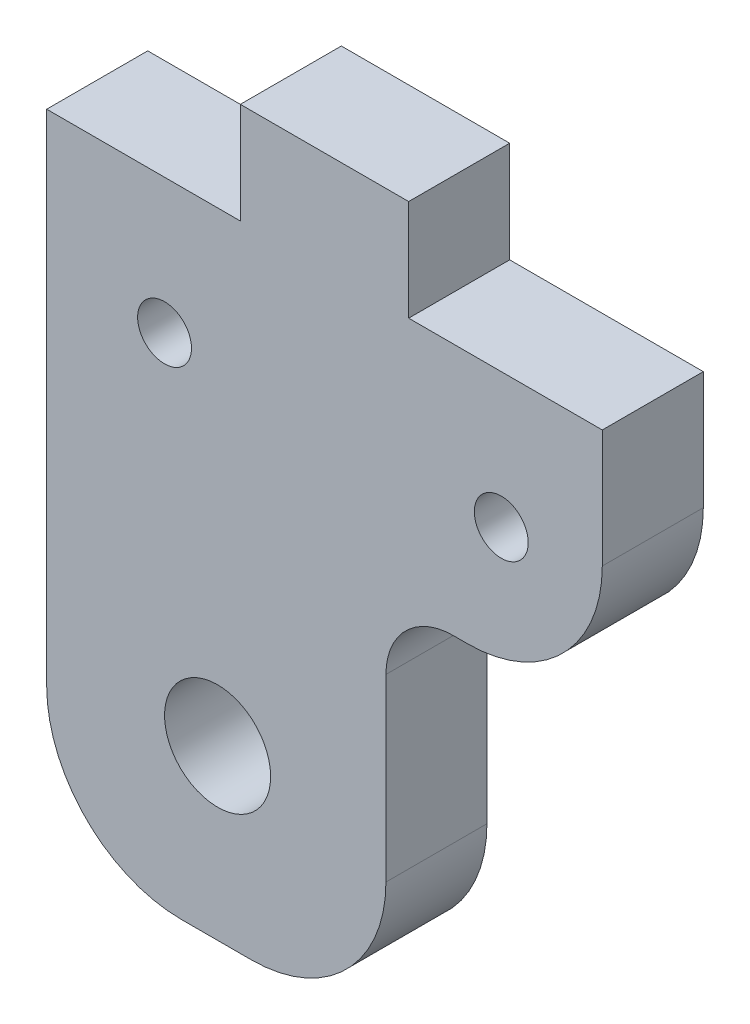
ISO-10303-21;
HEADER;
FILE_DESCRIPTION(('STEP AP214'),'2;1');
FILE_NAME('part.step','',(''),(''),'','','');
FILE_SCHEMA(('AUTOMOTIVE_DESIGN { 1 0 10303 214 1 1 1 1 }'));
ENDSEC;
DATA;
#1=APPLICATION_CONTEXT('core data for automotive mechanical design processes');
#2=APPLICATION_PROTOCOL_DEFINITION('international standard','automotive_design',2000,#1);
#3=PRODUCT_CONTEXT('',#1,'mechanical');
#4=PRODUCT('Part','Part','',(#3));
#5=PRODUCT_RELATED_PRODUCT_CATEGORY('part','',(#4));
#6=PRODUCT_DEFINITION_FORMATION('','',#4);
#7=PRODUCT_DEFINITION_CONTEXT('part definition',#1,'design');
#8=PRODUCT_DEFINITION('design','',#6,#7);
#9=PRODUCT_DEFINITION_SHAPE('','',#8);
#10=(LENGTH_UNIT() NAMED_UNIT(*) SI_UNIT(.MILLI.,.METRE.));
#11=(NAMED_UNIT(*) PLANE_ANGLE_UNIT() SI_UNIT($,.RADIAN.));
#12=(NAMED_UNIT(*) SI_UNIT($,.STERADIAN.) SOLID_ANGLE_UNIT());
#13=UNCERTAINTY_MEASURE_WITH_UNIT(LENGTH_MEASURE(1.E-05),#10,'distance_accuracy_value','');
#14=(GEOMETRIC_REPRESENTATION_CONTEXT(3) GLOBAL_UNCERTAINTY_ASSIGNED_CONTEXT((#13)) GLOBAL_UNIT_ASSIGNED_CONTEXT((#10,
#11,#12)) REPRESENTATION_CONTEXT('',''));
#15=CARTESIAN_POINT('',(0.,0.,0.));
#16=DIRECTION('',(0.,0.,1.));
#17=DIRECTION('',(1.,0.,0.));
#18=AXIS2_PLACEMENT_3D('',#15,#16,#17);
#19=CARTESIAN_POINT('',(29.15,0.,6.));
#20=DIRECTION('',(-1.,0.,0.));
#21=DIRECTION('',(0.,0.,1.));
#22=AXIS2_PLACEMENT_3D('',#19,#20,#21);
#23=PLANE('',#22);
#24=DIRECTION('',(0.,1.,0.));
#25=VECTOR('',#24,1.);
#26=CARTESIAN_POINT('',(29.15,0.,6.));
#27=LINE('',#26,#25);
#28=CARTESIAN_POINT('',(29.15,-29.6808495852448,6.));
#29=VERTEX_POINT('',#28);
#30=CARTESIAN_POINT('',(29.15,-19.,6.));
#31=VERTEX_POINT('',#30);
#32=EDGE_CURVE('E278',#29,#31,#27,.T.);
#33=ORIENTED_EDGE('',*,*,#32,.F.);
#34=DIRECTION('',(0.,0.,1.));
#35=VECTOR('',#34,1.);
#36=CARTESIAN_POINT('',(29.15,-29.6808495852448,0.));
#37=LINE('',#36,#35);
#38=CARTESIAN_POINT('',(29.15,-29.6808495852448,0.));
#39=VERTEX_POINT('',#38);
#40=EDGE_CURVE('E239',#29,#39,#37,.F.);
#41=ORIENTED_EDGE('',*,*,#40,.T.);
#42=DIRECTION('',(0.,1.,0.));
#43=VECTOR('',#42,1.);
#44=CARTESIAN_POINT('',(29.15,0.,0.));
#45=LINE('',#44,#43);
#46=CARTESIAN_POINT('',(29.15,-19.,0.));
#47=VERTEX_POINT('',#46);
#48=EDGE_CURVE('E192',#39,#47,#45,.T.);
#49=ORIENTED_EDGE('',*,*,#48,.T.);
#50=DIRECTION('',(0.,0.,-1.));
#51=VECTOR('',#50,1.);
#52=CARTESIAN_POINT('',(29.15,-19.,6.));
#53=LINE('',#52,#51);
#54=EDGE_CURVE('E218',#47,#31,#53,.F.);
#55=ORIENTED_EDGE('',*,*,#54,.T.);
#56=EDGE_LOOP('',(#33,#41,#49,#55));
#57=FACE_BOUND('',#56,.T.);
#58=ADVANCED_FACE('F35',(#57),#23,.F.);
#59=CARTESIAN_POINT('',(0.,0.,6.));
#60=DIRECTION('',(0.,0.,1.));
#61=DIRECTION('',(1.,0.,0.));
#62=AXIS2_PLACEMENT_3D('',#59,#60,#61);
#63=PLANE('',#62);
#64=CARTESIAN_POINT('',(16.,-8.,6.));
#65=DIRECTION('',(0.,0.,1.));
#66=DIRECTION('',(1.,0.,0.));
#67=AXIS2_PLACEMENT_3D('',#64,#65,#66);
#68=CIRCLE('',#67,1.6);
#69=CARTESIAN_POINT('',(17.6,-8.,6.));
#70=VERTEX_POINT('',#69);
#71=EDGE_CURVE('E263',#70,#70,#68,.T.);
#72=ORIENTED_EDGE('',*,*,#71,.F.);
#73=EDGE_LOOP('',(#72));
#74=FACE_BOUND('',#73,.T.);
#75=CARTESIAN_POINT('',(36.,-8.,6.));
#76=DIRECTION('',(0.,0.,1.));
#77=DIRECTION('',(1.,0.,0.));
#78=AXIS2_PLACEMENT_3D('',#75,#76,#77);
#79=CIRCLE('',#78,1.5999999999999);
#80=CARTESIAN_POINT('',(37.5999999999999,-8.,6.));
#81=VERTEX_POINT('',#80);
#82=EDGE_CURVE('E265',#81,#81,#79,.T.);
#83=ORIENTED_EDGE('',*,*,#82,.F.);
#84=EDGE_LOOP('',(#83));
#85=FACE_BOUND('',#84,.T.);
#86=CARTESIAN_POINT('',(19.15,-27.6808495852448,6.));
#87=DIRECTION('',(0.,0.,1.));
#88=DIRECTION('',(1.,0.,0.));
#89=AXIS2_PLACEMENT_3D('',#86,#87,#88);
#90=CIRCLE('',#89,3.14999999999995);
#91=CARTESIAN_POINT('',(22.3,-27.6808495852448,6.));
#92=VERTEX_POINT('',#91);
#93=EDGE_CURVE('E270',#92,#92,#90,.T.);
#94=ORIENTED_EDGE('',*,*,#93,.F.);
#95=EDGE_LOOP('',(#94));
#96=FACE_BOUND('',#95,.T.);
#97=DIRECTION('',(1.,0.,0.));
#98=VECTOR('',#97,1.);
#99=CARTESIAN_POINT('',(0.,-37.6808495852448,6.));
#100=LINE('',#99,#98);
#101=CARTESIAN_POINT('',(17.,-37.6808495852448,6.));
#102=VERTEX_POINT('',#101);
#103=CARTESIAN_POINT('',(21.15,-37.6808495852448,6.));
#104=VERTEX_POINT('',#103);
#105=EDGE_CURVE('E184',#102,#104,#100,.T.);
#106=ORIENTED_EDGE('',*,*,#105,.T.);
#107=CARTESIAN_POINT('',(21.15,-29.6808495852448,6.));
#108=DIRECTION('',(0.,0.,1.));
#109=DIRECTION('',(1.,0.,0.));
#110=AXIS2_PLACEMENT_3D('',#107,#108,#109);
#111=CIRCLE('',#110,8.);
#112=EDGE_CURVE('E237',#104,#29,#111,.T.);
#113=ORIENTED_EDGE('',*,*,#112,.T.);
#114=ORIENTED_EDGE('',*,*,#32,.T.);
#115=CARTESIAN_POINT('',(33.15,-19.,6.));
#116=DIRECTION('',(0.,0.,1.));
#117=DIRECTION('',(1.,0.,0.));
#118=AXIS2_PLACEMENT_3D('',#115,#116,#117);
#119=CIRCLE('',#118,4.);
#120=CARTESIAN_POINT('',(33.15,-15.,6.));
#121=VERTEX_POINT('',#120);
#122=EDGE_CURVE('E224',#31,#121,#119,.F.);
#123=ORIENTED_EDGE('',*,*,#122,.T.);
#124=DIRECTION('',(1.,0.,0.));
#125=VECTOR('',#124,1.);
#126=CARTESIAN_POINT('',(0.,-15.,6.));
#127=LINE('',#126,#125);
#128=CARTESIAN_POINT('',(34.,-15.,6.));
#129=VERTEX_POINT('',#128);
#130=EDGE_CURVE('E158',#121,#129,#127,.T.);
#131=ORIENTED_EDGE('',*,*,#130,.T.);
#132=CARTESIAN_POINT('',(34.,-7.,6.));
#133=DIRECTION('',(0.,0.,1.));
#134=DIRECTION('',(1.,0.,0.));
#135=AXIS2_PLACEMENT_3D('',#132,#133,#134);
#136=CIRCLE('',#135,8.);
#137=CARTESIAN_POINT('',(42.,-7.,6.));
#138=VERTEX_POINT('',#137);
#139=EDGE_CURVE('E157',#129,#138,#136,.T.);
#140=ORIENTED_EDGE('',*,*,#139,.T.);
#141=DIRECTION('',(0.,-1.,0.));
#142=VECTOR('',#141,1.);
#143=CARTESIAN_POINT('',(42.,0.,6.));
#144=LINE('',#143,#142);
#145=CARTESIAN_POINT('',(42.,0.,6.));
#146=VERTEX_POINT('',#145);
#147=EDGE_CURVE('E139',#146,#138,#144,.T.);
#148=ORIENTED_EDGE('',*,*,#147,.F.);
#149=DIRECTION('',(1.,0.,0.));
#150=VECTOR('',#149,1.);
#151=CARTESIAN_POINT('',(0.,0.,6.));
#152=LINE('',#151,#150);
#153=CARTESIAN_POINT('',(30.5,0.,6.));
#154=VERTEX_POINT('',#153);
#155=EDGE_CURVE('E153',#154,#146,#152,.T.);
#156=ORIENTED_EDGE('',*,*,#155,.F.);
#157=DIRECTION('',(0.,-1.,0.));
#158=VECTOR('',#157,1.);
#159=CARTESIAN_POINT('',(30.5,0.,6.));
#160=LINE('',#159,#158);
#161=CARTESIAN_POINT('',(30.5,6.,6.));
#162=VERTEX_POINT('',#161);
#163=EDGE_CURVE('E161',#162,#154,#160,.T.);
#164=ORIENTED_EDGE('',*,*,#163,.F.);
#165=DIRECTION('',(-1.,0.,0.));
#166=VECTOR('',#165,1.);
#167=CARTESIAN_POINT('',(0.,6.,6.));
#168=LINE('',#167,#166);
#169=CARTESIAN_POINT('',(20.5,6.,6.));
#170=VERTEX_POINT('',#169);
#171=EDGE_CURVE('E164',#162,#170,#168,.T.);
#172=ORIENTED_EDGE('',*,*,#171,.T.);
#173=DIRECTION('',(0.,-1.,0.));
#174=VECTOR('',#173,1.);
#175=CARTESIAN_POINT('',(20.5,0.,6.));
#176=LINE('',#175,#174);
#177=CARTESIAN_POINT('',(20.5,0.,6.));
#178=VERTEX_POINT('',#177);
#179=EDGE_CURVE('E168',#170,#178,#176,.T.);
#180=ORIENTED_EDGE('',*,*,#179,.T.);
#181=CARTESIAN_POINT('',(9.,0.,6.));
#182=VERTEX_POINT('',#181);
#183=EDGE_CURVE('E163',#182,#178,#152,.T.);
#184=ORIENTED_EDGE('',*,*,#183,.F.);
#185=DIRECTION('',(0.,1.,0.));
#186=VECTOR('',#185,1.);
#187=CARTESIAN_POINT('',(9.,0.,6.));
#188=LINE('',#187,#186);
#189=CARTESIAN_POINT('',(9.,-29.6808495852448,6.));
#190=VERTEX_POINT('',#189);
#191=EDGE_CURVE('E276',#190,#182,#188,.T.);
#192=ORIENTED_EDGE('',*,*,#191,.F.);
#193=CARTESIAN_POINT('',(17.,-29.6808495852448,6.));
#194=DIRECTION('',(0.,0.,1.));
#195=DIRECTION('',(1.,0.,0.));
#196=AXIS2_PLACEMENT_3D('',#193,#194,#195);
#197=CIRCLE('',#196,8.);
#198=EDGE_CURVE('E235',#190,#102,#197,.T.);
#199=ORIENTED_EDGE('',*,*,#198,.T.);
#200=EDGE_LOOP('',(#106,#113,#114,#123,#131,#140,#148,#156,#164,#172,#180,#184,#192,#199));
#201=FACE_BOUND('',#200,.T.);
#202=ADVANCED_FACE('F151',(#74,#85,#96,#201),#63,.T.);
#203=CARTESIAN_POINT('',(0.,0.,0.));
#204=DIRECTION('',(0.,0.,1.));
#205=DIRECTION('',(1.,0.,0.));
#206=AXIS2_PLACEMENT_3D('',#203,#204,#205);
#207=PLANE('',#206);
#208=CARTESIAN_POINT('',(19.15,-27.6808495852448,0.));
#209=DIRECTION('',(0.,0.,1.));
#210=DIRECTION('',(1.,0.,0.));
#211=AXIS2_PLACEMENT_3D('',#208,#209,#210);
#212=CIRCLE('',#211,3.14999999999995);
#213=CARTESIAN_POINT('',(22.3,-27.6808495852448,0.));
#214=VERTEX_POINT('',#213);
#215=EDGE_CURVE('E187',#214,#214,#212,.T.);
#216=ORIENTED_EDGE('',*,*,#215,.T.);
#217=EDGE_LOOP('',(#216));
#218=FACE_BOUND('',#217,.T.);
#219=CARTESIAN_POINT('',(36.,-8.,0.));
#220=DIRECTION('',(0.,0.,1.));
#221=DIRECTION('',(1.,0.,0.));
#222=AXIS2_PLACEMENT_3D('',#219,#220,#221);
#223=CIRCLE('',#222,1.5999999999999);
#224=CARTESIAN_POINT('',(37.5999999999999,-8.,0.));
#225=VERTEX_POINT('',#224);
#226=EDGE_CURVE('E183',#225,#225,#223,.T.);
#227=ORIENTED_EDGE('',*,*,#226,.T.);
#228=EDGE_LOOP('',(#227));
#229=FACE_BOUND('',#228,.T.);
#230=CARTESIAN_POINT('',(16.,-8.,0.));
#231=DIRECTION('',(0.,0.,1.));
#232=DIRECTION('',(1.,0.,0.));
#233=AXIS2_PLACEMENT_3D('',#230,#231,#232);
#234=CIRCLE('',#233,1.6);
#235=CARTESIAN_POINT('',(17.6,-8.,0.));
#236=VERTEX_POINT('',#235);
#237=EDGE_CURVE('E180',#236,#236,#234,.T.);
#238=ORIENTED_EDGE('',*,*,#237,.T.);
#239=EDGE_LOOP('',(#238));
#240=FACE_BOUND('',#239,.T.);
#241=ORIENTED_EDGE('',*,*,#48,.F.);
#242=CARTESIAN_POINT('',(21.15,-29.6808495852448,0.));
#243=DIRECTION('',(0.,0.,1.));
#244=DIRECTION('',(1.,0.,0.));
#245=AXIS2_PLACEMENT_3D('',#242,#243,#244);
#246=CIRCLE('',#245,8.);
#247=CARTESIAN_POINT('',(21.15,-37.6808495852448,0.));
#248=VERTEX_POINT('',#247);
#249=EDGE_CURVE('E244',#39,#248,#246,.F.);
#250=ORIENTED_EDGE('',*,*,#249,.T.);
#251=DIRECTION('',(1.,0.,0.));
#252=VECTOR('',#251,1.);
#253=CARTESIAN_POINT('',(0.,-37.6808495852448,0.));
#254=LINE('',#253,#252);
#255=CARTESIAN_POINT('',(17.,-37.6808495852448,0.));
#256=VERTEX_POINT('',#255);
#257=EDGE_CURVE('E226',#256,#248,#254,.T.);
#258=ORIENTED_EDGE('',*,*,#257,.F.);
#259=CARTESIAN_POINT('',(17.,-29.6808495852448,0.));
#260=DIRECTION('',(0.,0.,1.));
#261=DIRECTION('',(1.,0.,0.));
#262=AXIS2_PLACEMENT_3D('',#259,#260,#261);
#263=CIRCLE('',#262,8.);
#264=CARTESIAN_POINT('',(9.,-29.6808495852448,0.));
#265=VERTEX_POINT('',#264);
#266=EDGE_CURVE('E242',#256,#265,#263,.F.);
#267=ORIENTED_EDGE('',*,*,#266,.T.);
#268=DIRECTION('',(0.,1.,0.));
#269=VECTOR('',#268,1.);
#270=CARTESIAN_POINT('',(9.,0.,0.));
#271=LINE('',#270,#269);
#272=CARTESIAN_POINT('',(9.,0.,0.));
#273=VERTEX_POINT('',#272);
#274=EDGE_CURVE('E190',#265,#273,#271,.T.);
#275=ORIENTED_EDGE('',*,*,#274,.T.);
#276=DIRECTION('',(1.,0.,0.));
#277=VECTOR('',#276,1.);
#278=CARTESIAN_POINT('',(0.,0.,0.));
#279=LINE('',#278,#277);
#280=CARTESIAN_POINT('',(20.5,0.,0.));
#281=VERTEX_POINT('',#280);
#282=EDGE_CURVE('E200',#273,#281,#279,.T.);
#283=ORIENTED_EDGE('',*,*,#282,.T.);
#284=DIRECTION('',(0.,-1.,0.));
#285=VECTOR('',#284,1.);
#286=CARTESIAN_POINT('',(20.5,0.,0.));
#287=LINE('',#286,#285);
#288=CARTESIAN_POINT('',(20.5,6.,0.));
#289=VERTEX_POINT('',#288);
#290=EDGE_CURVE('E206',#289,#281,#287,.T.);
#291=ORIENTED_EDGE('',*,*,#290,.F.);
#292=DIRECTION('',(-1.,0.,0.));
#293=VECTOR('',#292,1.);
#294=CARTESIAN_POINT('',(0.,6.,0.));
#295=LINE('',#294,#293);
#296=CARTESIAN_POINT('',(30.5,6.,0.));
#297=VERTEX_POINT('',#296);
#298=EDGE_CURVE('E203',#297,#289,#295,.T.);
#299=ORIENTED_EDGE('',*,*,#298,.F.);
#300=DIRECTION('',(0.,-1.,0.));
#301=VECTOR('',#300,1.);
#302=CARTESIAN_POINT('',(30.5,0.,0.));
#303=LINE('',#302,#301);
#304=CARTESIAN_POINT('',(30.5,0.,0.));
#305=VERTEX_POINT('',#304);
#306=EDGE_CURVE('E199',#297,#305,#303,.T.);
#307=ORIENTED_EDGE('',*,*,#306,.T.);
#308=CARTESIAN_POINT('',(42.,0.,0.));
#309=VERTEX_POINT('',#308);
#310=EDGE_CURVE('E197',#305,#309,#279,.T.);
#311=ORIENTED_EDGE('',*,*,#310,.T.);
#312=DIRECTION('',(0.,-1.,0.));
#313=VECTOR('',#312,1.);
#314=CARTESIAN_POINT('',(42.,0.,0.));
#315=LINE('',#314,#313);
#316=CARTESIAN_POINT('',(42.,-7.,0.));
#317=VERTEX_POINT('',#316);
#318=EDGE_CURVE('E140',#309,#317,#315,.T.);
#319=ORIENTED_EDGE('',*,*,#318,.T.);
#320=CARTESIAN_POINT('',(34.,-7.,0.));
#321=DIRECTION('',(0.,0.,1.));
#322=DIRECTION('',(1.,0.,0.));
#323=AXIS2_PLACEMENT_3D('',#320,#321,#322);
#324=CIRCLE('',#323,8.);
#325=CARTESIAN_POINT('',(34.,-15.,0.));
#326=VERTEX_POINT('',#325);
#327=EDGE_CURVE('E50',#317,#326,#324,.F.);
#328=ORIENTED_EDGE('',*,*,#327,.T.);
#329=DIRECTION('',(1.,0.,0.));
#330=VECTOR('',#329,1.);
#331=CARTESIAN_POINT('',(0.,-15.,0.));
#332=LINE('',#331,#330);
#333=CARTESIAN_POINT('',(33.15,-15.,0.));
#334=VERTEX_POINT('',#333);
#335=EDGE_CURVE('E194',#334,#326,#332,.T.);
#336=ORIENTED_EDGE('',*,*,#335,.F.);
#337=CARTESIAN_POINT('',(33.15,-19.,0.));
#338=DIRECTION('',(0.,0.,1.));
#339=DIRECTION('',(1.,0.,0.));
#340=AXIS2_PLACEMENT_3D('',#337,#338,#339);
#341=CIRCLE('',#340,4.);
#342=EDGE_CURVE('E221',#334,#47,#341,.T.);
#343=ORIENTED_EDGE('',*,*,#342,.T.);
#344=EDGE_LOOP('',(#241,#250,#258,#267,#275,#283,#291,#299,#307,#311,#319,#328,#336,#343));
#345=FACE_BOUND('',#344,.T.);
#346=ADVANCED_FACE('F249',(#218,#229,#240,#345),#207,.F.);
#347=CARTESIAN_POINT('',(9.,0.,6.));
#348=DIRECTION('',(-1.,0.,0.));
#349=DIRECTION('',(0.,0.,1.));
#350=AXIS2_PLACEMENT_3D('',#347,#348,#349);
#351=PLANE('',#350);
#352=ORIENTED_EDGE('',*,*,#274,.F.);
#353=DIRECTION('',(0.,0.,1.));
#354=VECTOR('',#353,1.);
#355=CARTESIAN_POINT('',(9.,-29.6808495852448,6.));
#356=LINE('',#355,#354);
#357=EDGE_CURVE('E246',#265,#190,#356,.T.);
#358=ORIENTED_EDGE('',*,*,#357,.T.);
#359=ORIENTED_EDGE('',*,*,#191,.T.);
#360=DIRECTION('',(0.,0.,-1.));
#361=VECTOR('',#360,1.);
#362=CARTESIAN_POINT('',(9.,0.,6.));
#363=LINE('',#362,#361);
#364=EDGE_CURVE('E167',#182,#273,#363,.T.);
#365=ORIENTED_EDGE('',*,*,#364,.T.);
#366=EDGE_LOOP('',(#352,#358,#359,#365));
#367=FACE_BOUND('',#366,.T.);
#368=ADVANCED_FACE('F306',(#367),#351,.T.);
#369=CARTESIAN_POINT('',(0.,-15.,6.));
#370=DIRECTION('',(0.,1.,0.));
#371=DIRECTION('',(-1.,0.,0.));
#372=AXIS2_PLACEMENT_3D('',#369,#370,#371);
#373=PLANE('',#372);
#374=ORIENTED_EDGE('',*,*,#335,.T.);
#375=DIRECTION('',(0.,0.,-1.));
#376=VECTOR('',#375,1.);
#377=CARTESIAN_POINT('',(34.,-15.,6.));
#378=LINE('',#377,#376);
#379=EDGE_CURVE('E11',#326,#129,#378,.F.);
#380=ORIENTED_EDGE('',*,*,#379,.T.);
#381=ORIENTED_EDGE('',*,*,#130,.F.);
#382=DIRECTION('',(0.,0.,-1.));
#383=VECTOR('',#382,1.);
#384=CARTESIAN_POINT('',(33.15,-15.,0.));
#385=LINE('',#384,#383);
#386=EDGE_CURVE('E145',#121,#334,#385,.T.);
#387=ORIENTED_EDGE('',*,*,#386,.T.);
#388=EDGE_LOOP('',(#374,#380,#381,#387));
#389=FACE_BOUND('',#388,.T.);
#390=ADVANCED_FACE('F284',(#389),#373,.F.);
#391=CARTESIAN_POINT('',(42.,0.,6.));
#392=DIRECTION('',(1.,0.,0.));
#393=DIRECTION('',(0.,1.,0.));
#394=AXIS2_PLACEMENT_3D('',#391,#392,#393);
#395=PLANE('',#394);
#396=ORIENTED_EDGE('',*,*,#147,.T.);
#397=DIRECTION('',(0.,0.,-1.));
#398=VECTOR('',#397,1.);
#399=CARTESIAN_POINT('',(42.,-7.,0.));
#400=LINE('',#399,#398);
#401=EDGE_CURVE('E43',#138,#317,#400,.T.);
#402=ORIENTED_EDGE('',*,*,#401,.T.);
#403=ORIENTED_EDGE('',*,*,#318,.F.);
#404=DIRECTION('',(0.,0.,-1.));
#405=VECTOR('',#404,1.);
#406=CARTESIAN_POINT('',(42.,0.,6.));
#407=LINE('',#406,#405);
#408=EDGE_CURVE('E136',#146,#309,#407,.T.);
#409=ORIENTED_EDGE('',*,*,#408,.F.);
#410=EDGE_LOOP('',(#396,#402,#403,#409));
#411=FACE_BOUND('',#410,.T.);
#412=ADVANCED_FACE('F138',(#411),#395,.T.);
#413=CARTESIAN_POINT('',(0.,0.,6.));
#414=DIRECTION('',(0.,1.,0.));
#415=DIRECTION('',(-1.,0.,0.));
#416=AXIS2_PLACEMENT_3D('',#413,#414,#415);
#417=PLANE('',#416);
#418=ORIENTED_EDGE('',*,*,#310,.F.);
#419=DIRECTION('',(0.,0.,-1.));
#420=VECTOR('',#419,1.);
#421=CARTESIAN_POINT('',(30.5,0.,6.));
#422=LINE('',#421,#420);
#423=EDGE_CURVE('E146',#154,#305,#422,.T.);
#424=ORIENTED_EDGE('',*,*,#423,.F.);
#425=ORIENTED_EDGE('',*,*,#155,.T.);
#426=ORIENTED_EDGE('',*,*,#408,.T.);
#427=EDGE_LOOP('',(#418,#424,#425,#426));
#428=FACE_BOUND('',#427,.T.);
#429=ADVANCED_FACE('F160',(#428),#417,.T.);
#430=CARTESIAN_POINT('',(30.5,0.,6.));
#431=DIRECTION('',(1.,0.,0.));
#432=DIRECTION('',(0.,1.,0.));
#433=AXIS2_PLACEMENT_3D('',#430,#431,#432);
#434=PLANE('',#433);
#435=ORIENTED_EDGE('',*,*,#306,.F.);
#436=DIRECTION('',(0.,0.,-1.));
#437=VECTOR('',#436,1.);
#438=CARTESIAN_POINT('',(30.5,6.,6.));
#439=LINE('',#438,#437);
#440=EDGE_CURVE('E213',#162,#297,#439,.T.);
#441=ORIENTED_EDGE('',*,*,#440,.F.);
#442=ORIENTED_EDGE('',*,*,#163,.T.);
#443=ORIENTED_EDGE('',*,*,#423,.T.);
#444=EDGE_LOOP('',(#435,#441,#442,#443));
#445=FACE_BOUND('',#444,.T.);
#446=ADVANCED_FACE('F253',(#445),#434,.T.);
#447=CARTESIAN_POINT('',(0.,6.,6.));
#448=DIRECTION('',(0.,-1.,0.));
#449=DIRECTION('',(1.,0.,0.));
#450=AXIS2_PLACEMENT_3D('',#447,#448,#449);
#451=PLANE('',#450);
#452=ORIENTED_EDGE('',*,*,#298,.T.);
#453=DIRECTION('',(0.,0.,-1.));
#454=VECTOR('',#453,1.);
#455=CARTESIAN_POINT('',(20.5,6.,6.));
#456=LINE('',#455,#454);
#457=EDGE_CURVE('E210',#170,#289,#456,.T.);
#458=ORIENTED_EDGE('',*,*,#457,.F.);
#459=ORIENTED_EDGE('',*,*,#171,.F.);
#460=ORIENTED_EDGE('',*,*,#440,.T.);
#461=EDGE_LOOP('',(#452,#458,#459,#460));
#462=FACE_BOUND('',#461,.T.);
#463=ADVANCED_FACE('F257',(#462),#451,.F.);
#464=CARTESIAN_POINT('',(20.5,0.,6.));
#465=DIRECTION('',(1.,0.,0.));
#466=DIRECTION('',(0.,0.,-1.));
#467=AXIS2_PLACEMENT_3D('',#464,#465,#466);
#468=PLANE('',#467);
#469=ORIENTED_EDGE('',*,*,#290,.T.);
#470=DIRECTION('',(0.,0.,-1.));
#471=VECTOR('',#470,1.);
#472=CARTESIAN_POINT('',(20.5,0.,6.));
#473=LINE('',#472,#471);
#474=EDGE_CURVE('E173',#178,#281,#473,.T.);
#475=ORIENTED_EDGE('',*,*,#474,.F.);
#476=ORIENTED_EDGE('',*,*,#179,.F.);
#477=ORIENTED_EDGE('',*,*,#457,.T.);
#478=EDGE_LOOP('',(#469,#475,#476,#477));
#479=FACE_BOUND('',#478,.T.);
#480=ADVANCED_FACE('F259',(#479),#468,.F.);
#481=CARTESIAN_POINT('',(19.15,-27.6808495852448,6.));
#482=DIRECTION('',(0.,0.,-1.));
#483=DIRECTION('',(-1.,0.,0.));
#484=AXIS2_PLACEMENT_3D('',#481,#482,#483);
#485=CYLINDRICAL_SURFACE('',#484,3.14999999999995);
#486=ORIENTED_EDGE('',*,*,#93,.T.);
#487=EDGE_LOOP('',(#486));
#488=FACE_BOUND('',#487,.T.);
#489=ORIENTED_EDGE('',*,*,#215,.F.);
#490=EDGE_LOOP('',(#489));
#491=FACE_BOUND('',#490,.T.);
#492=ADVANCED_FACE('F334',(#488,#491),#485,.F.);
#493=CARTESIAN_POINT('',(36.,-8.,6.));
#494=DIRECTION('',(0.,0.,-1.));
#495=DIRECTION('',(-1.,0.,0.));
#496=AXIS2_PLACEMENT_3D('',#493,#494,#495);
#497=CYLINDRICAL_SURFACE('',#496,1.5999999999999);
#498=ORIENTED_EDGE('',*,*,#82,.T.);
#499=EDGE_LOOP('',(#498));
#500=FACE_BOUND('',#499,.T.);
#501=ORIENTED_EDGE('',*,*,#226,.F.);
#502=EDGE_LOOP('',(#501));
#503=FACE_BOUND('',#502,.T.);
#504=ADVANCED_FACE('F429',(#500,#503),#497,.F.);
#505=CARTESIAN_POINT('',(16.,-8.,6.));
#506=DIRECTION('',(0.,0.,-1.));
#507=DIRECTION('',(-1.,0.,0.));
#508=AXIS2_PLACEMENT_3D('',#505,#506,#507);
#509=CYLINDRICAL_SURFACE('',#508,1.6);
#510=ORIENTED_EDGE('',*,*,#71,.T.);
#511=EDGE_LOOP('',(#510));
#512=FACE_BOUND('',#511,.T.);
#513=ORIENTED_EDGE('',*,*,#237,.F.);
#514=EDGE_LOOP('',(#513));
#515=FACE_BOUND('',#514,.T.);
#516=ADVANCED_FACE('F336',(#512,#515),#509,.F.);
#517=ORIENTED_EDGE('',*,*,#282,.F.);
#518=ORIENTED_EDGE('',*,*,#364,.F.);
#519=ORIENTED_EDGE('',*,*,#183,.T.);
#520=ORIENTED_EDGE('',*,*,#474,.T.);
#521=EDGE_LOOP('',(#517,#518,#519,#520));
#522=FACE_BOUND('',#521,.T.);
#523=ADVANCED_FACE('F262',(#522),#417,.T.);
#524=CARTESIAN_POINT('',(33.15,-19.,6.));
#525=DIRECTION('',(0.,0.,1.));
#526=DIRECTION('',(1.,0.,0.));
#527=AXIS2_PLACEMENT_3D('',#524,#525,#526);
#528=CYLINDRICAL_SURFACE('',#527,4.);
#529=ORIENTED_EDGE('',*,*,#122,.F.);
#530=ORIENTED_EDGE('',*,*,#54,.F.);
#531=ORIENTED_EDGE('',*,*,#342,.F.);
#532=ORIENTED_EDGE('',*,*,#386,.F.);
#533=EDGE_LOOP('',(#529,#530,#531,#532));
#534=FACE_BOUND('',#533,.T.);
#535=ADVANCED_FACE('F288',(#534),#528,.F.);
#536=CARTESIAN_POINT('',(0.,-37.6808495852448,-4.));
#537=DIRECTION('',(0.,-1.,0.));
#538=DIRECTION('',(0.,0.,-1.));
#539=AXIS2_PLACEMENT_3D('',#536,#537,#538);
#540=PLANE('',#539);
#541=ORIENTED_EDGE('',*,*,#257,.T.);
#542=DIRECTION('',(0.,0.,1.));
#543=VECTOR('',#542,1.);
#544=CARTESIAN_POINT('',(21.15,-37.6808495852448,6.));
#545=LINE('',#544,#543);
#546=EDGE_CURVE('E231',#248,#104,#545,.T.);
#547=ORIENTED_EDGE('',*,*,#546,.T.);
#548=ORIENTED_EDGE('',*,*,#105,.F.);
#549=DIRECTION('',(0.,0.,1.));
#550=VECTOR('',#549,1.);
#551=CARTESIAN_POINT('',(17.,-37.6808495852448,-4.));
#552=LINE('',#551,#550);
#553=EDGE_CURVE('E229',#102,#256,#552,.F.);
#554=ORIENTED_EDGE('',*,*,#553,.T.);
#555=EDGE_LOOP('',(#541,#547,#548,#554));
#556=FACE_BOUND('',#555,.T.);
#557=ADVANCED_FACE('F298',(#556),#540,.T.);
#558=CARTESIAN_POINT('',(21.15,-29.6808495852448,-4.));
#559=DIRECTION('',(0.,0.,-1.));
#560=DIRECTION('',(-1.,0.,0.));
#561=AXIS2_PLACEMENT_3D('',#558,#559,#560);
#562=CYLINDRICAL_SURFACE('',#561,8.);
#563=ORIENTED_EDGE('',*,*,#249,.F.);
#564=ORIENTED_EDGE('',*,*,#40,.F.);
#565=ORIENTED_EDGE('',*,*,#112,.F.);
#566=ORIENTED_EDGE('',*,*,#546,.F.);
#567=EDGE_LOOP('',(#563,#564,#565,#566));
#568=FACE_BOUND('',#567,.T.);
#569=ADVANCED_FACE('F293',(#568),#562,.T.);
#570=CARTESIAN_POINT('',(17.,-29.6808495852448,6.));
#571=DIRECTION('',(0.,0.,1.));
#572=DIRECTION('',(1.,0.,0.));
#573=AXIS2_PLACEMENT_3D('',#570,#571,#572);
#574=CYLINDRICAL_SURFACE('',#573,8.);
#575=ORIENTED_EDGE('',*,*,#266,.F.);
#576=ORIENTED_EDGE('',*,*,#553,.F.);
#577=ORIENTED_EDGE('',*,*,#198,.F.);
#578=ORIENTED_EDGE('',*,*,#357,.F.);
#579=EDGE_LOOP('',(#575,#576,#577,#578));
#580=FACE_BOUND('',#579,.T.);
#581=ADVANCED_FACE('F302',(#580),#574,.T.);
#582=CARTESIAN_POINT('',(34.,-7.,6.));
#583=DIRECTION('',(0.,0.,1.));
#584=DIRECTION('',(1.,0.,0.));
#585=AXIS2_PLACEMENT_3D('',#582,#583,#584);
#586=CYLINDRICAL_SURFACE('',#585,8.);
#587=ORIENTED_EDGE('',*,*,#139,.F.);
#588=ORIENTED_EDGE('',*,*,#379,.F.);
#589=ORIENTED_EDGE('',*,*,#327,.F.);
#590=ORIENTED_EDGE('',*,*,#401,.F.);
#591=EDGE_LOOP('',(#587,#588,#589,#590));
#592=FACE_BOUND('',#591,.T.);
#593=ADVANCED_FACE('F37',(#592),#586,.T.);
#594=CLOSED_SHELL('',(#58,#202,#346,#368,#390,#412,#429,#446,#463,#480,#492,#504,#516,#523,#535,
#557,#569,#581,#593));
#595=MANIFOLD_SOLID_BREP('B2',#594);
#596=ADVANCED_BREP_SHAPE_REPRESENTATION('',(#18,#595),#14);
#597=SHAPE_DEFINITION_REPRESENTATION(#9,#596);
ENDSEC;
END-ISO-10303-21;
